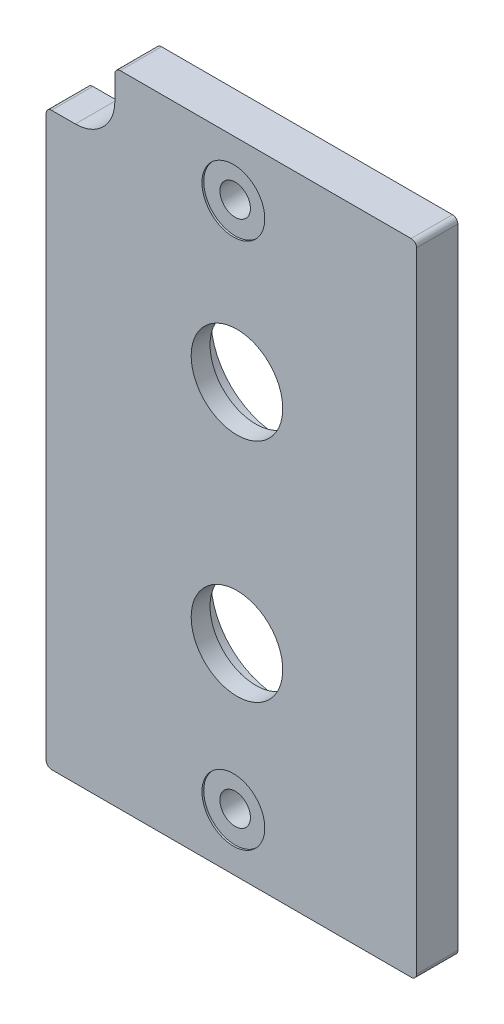
ISO-10303-21;
HEADER;
FILE_DESCRIPTION(('STEP AP214'),'2;1');
FILE_NAME('part.step','',(''),(''),'','','');
FILE_SCHEMA(('AUTOMOTIVE_DESIGN { 1 0 10303 214 1 1 1 1 }'));
ENDSEC;
DATA;
#1=APPLICATION_CONTEXT('core data for automotive mechanical design processes');
#2=APPLICATION_PROTOCOL_DEFINITION('international standard','automotive_design',2000,#1);
#3=PRODUCT_CONTEXT('',#1,'mechanical');
#4=PRODUCT('Part','Part','',(#3));
#5=PRODUCT_RELATED_PRODUCT_CATEGORY('part','',(#4));
#6=PRODUCT_DEFINITION_FORMATION('','',#4);
#7=PRODUCT_DEFINITION_CONTEXT('part definition',#1,'design');
#8=PRODUCT_DEFINITION('design','',#6,#7);
#9=PRODUCT_DEFINITION_SHAPE('','',#8);
#10=(LENGTH_UNIT() NAMED_UNIT(*) SI_UNIT(.MILLI.,.METRE.));
#11=(NAMED_UNIT(*) PLANE_ANGLE_UNIT() SI_UNIT($,.RADIAN.));
#12=(NAMED_UNIT(*) SI_UNIT($,.STERADIAN.) SOLID_ANGLE_UNIT());
#13=UNCERTAINTY_MEASURE_WITH_UNIT(LENGTH_MEASURE(1.E-05),#10,'distance_accuracy_value','');
#14=(GEOMETRIC_REPRESENTATION_CONTEXT(3) GLOBAL_UNCERTAINTY_ASSIGNED_CONTEXT((#13)) GLOBAL_UNIT_ASSIGNED_CONTEXT((#10,
#11,#12)) REPRESENTATION_CONTEXT('',''));
#15=CARTESIAN_POINT('',(0.,0.,0.));
#16=DIRECTION('',(0.,0.,1.));
#17=DIRECTION('',(1.,0.,0.));
#18=AXIS2_PLACEMENT_3D('',#15,#16,#17);
#19=CARTESIAN_POINT('',(-28.448,126.365,7.1755));
#20=DIRECTION('',(0.,0.,-1.));
#21=DIRECTION('',(-1.,0.,0.));
#22=AXIS2_PLACEMENT_3D('',#19,#20,#21);
#23=CYLINDRICAL_SURFACE('',#22,2.15900000000002);
#24=CARTESIAN_POINT('',(-28.448,126.365,1.5875));
#25=DIRECTION('',(0.,0.,-1.));
#26=DIRECTION('',(-1.,0.,0.));
#27=AXIS2_PLACEMENT_3D('',#24,#25,#26);
#28=CIRCLE('',#27,2.15900000000002);
#29=CARTESIAN_POINT('',(-30.607,126.365,1.5875));
#30=VERTEX_POINT('',#29);
#31=EDGE_CURVE('E216',#30,#30,#28,.F.);
#32=ORIENTED_EDGE('',*,*,#31,.F.);
#33=EDGE_LOOP('',(#32));
#34=FACE_BOUND('',#33,.T.);
#35=CARTESIAN_POINT('',(-28.448,126.365,7.1755));
#36=DIRECTION('',(0.,0.,-1.));
#37=DIRECTION('',(-1.,0.,0.));
#38=AXIS2_PLACEMENT_3D('',#35,#36,#37);
#39=CIRCLE('',#38,2.15900000000002);
#40=CARTESIAN_POINT('',(-30.607,126.365,7.1755));
#41=VERTEX_POINT('',#40);
#42=EDGE_CURVE('E238',#41,#41,#39,.T.);
#43=ORIENTED_EDGE('',*,*,#42,.F.);
#44=EDGE_LOOP('',(#43));
#45=FACE_BOUND('',#44,.T.);
#46=ADVANCED_FACE('F16',(#34,#45),#23,.F.);
#47=CARTESIAN_POINT('',(-27.94,72.39,1.5875));
#48=DIRECTION('',(0.,0.,1.));
#49=DIRECTION('',(1.,0.,0.));
#50=AXIS2_PLACEMENT_3D('',#47,#48,#49);
#51=CYLINDRICAL_SURFACE('',#50,9.525);
#52=CARTESIAN_POINT('',(-27.94,72.39,4.7625));
#53=DIRECTION('',(0.,0.,1.));
#54=DIRECTION('',(1.,0.,0.));
#55=AXIS2_PLACEMENT_3D('',#52,#53,#54);
#56=CIRCLE('',#55,9.525);
#57=CARTESIAN_POINT('',(-18.415,72.39,4.7625));
#58=VERTEX_POINT('',#57);
#59=EDGE_CURVE('E232',#58,#58,#56,.F.);
#60=ORIENTED_EDGE('',*,*,#59,.F.);
#61=EDGE_LOOP('',(#60));
#62=FACE_BOUND('',#61,.T.);
#63=CARTESIAN_POINT('',(-27.94,72.39,1.5875));
#64=DIRECTION('',(0.,0.,1.));
#65=DIRECTION('',(1.,0.,0.));
#66=AXIS2_PLACEMENT_3D('',#63,#64,#65);
#67=CIRCLE('',#66,9.525);
#68=CARTESIAN_POINT('',(-18.415,72.39,1.5875));
#69=VERTEX_POINT('',#68);
#70=EDGE_CURVE('E213',#69,#69,#67,.T.);
#71=ORIENTED_EDGE('',*,*,#70,.F.);
#72=EDGE_LOOP('',(#71));
#73=FACE_BOUND('',#72,.T.);
#74=ADVANCED_FACE('F504',(#62,#73),#51,.F.);
#75=CARTESIAN_POINT('',(-27.94,104.394,1.5875));
#76=DIRECTION('',(0.,0.,1.));
#77=DIRECTION('',(1.,0.,0.));
#78=AXIS2_PLACEMENT_3D('',#75,#76,#77);
#79=CYLINDRICAL_SURFACE('',#78,9.52499999999999);
#80=CARTESIAN_POINT('',(-27.94,104.394,4.7625));
#81=DIRECTION('',(0.,0.,1.));
#82=DIRECTION('',(1.,0.,0.));
#83=AXIS2_PLACEMENT_3D('',#80,#81,#82);
#84=CIRCLE('',#83,9.52499999999999);
#85=CARTESIAN_POINT('',(-18.415,104.394,4.7625));
#86=VERTEX_POINT('',#85);
#87=EDGE_CURVE('E235',#86,#86,#84,.F.);
#88=ORIENTED_EDGE('',*,*,#87,.F.);
#89=EDGE_LOOP('',(#88));
#90=FACE_BOUND('',#89,.T.);
#91=CARTESIAN_POINT('',(-27.94,104.394,1.5875));
#92=DIRECTION('',(0.,0.,1.));
#93=DIRECTION('',(1.,0.,0.));
#94=AXIS2_PLACEMENT_3D('',#91,#92,#93);
#95=CIRCLE('',#94,9.52499999999999);
#96=CARTESIAN_POINT('',(-18.415,104.394,1.5875));
#97=VERTEX_POINT('',#96);
#98=EDGE_CURVE('E171',#97,#97,#95,.T.);
#99=ORIENTED_EDGE('',*,*,#98,.F.);
#100=EDGE_LOOP('',(#99));
#101=FACE_BOUND('',#100,.T.);
#102=ADVANCED_FACE('F496',(#90,#101),#79,.F.);
#103=CARTESIAN_POINT('',(-54.1654999999997,44.577,7.4295));
#104=DIRECTION('',(0.,0.,-1.));
#105=DIRECTION('',(-1.,0.,0.));
#106=AXIS2_PLACEMENT_3D('',#103,#104,#105);
#107=CYLINDRICAL_SURFACE('',#106,0.762000000000004);
#108=CARTESIAN_POINT('',(-54.1654999999997,44.577,1.5875));
#109=DIRECTION('',(0.,0.,-1.));
#110=DIRECTION('',(-1.,0.,0.));
#111=AXIS2_PLACEMENT_3D('',#108,#109,#110);
#112=CIRCLE('',#111,0.762000000000004);
#113=CARTESIAN_POINT('',(-54.1654999999997,43.815,1.5875));
#114=VERTEX_POINT('',#113);
#115=CARTESIAN_POINT('',(-54.9274999999997,44.577,1.5875));
#116=VERTEX_POINT('',#115);
#117=EDGE_CURVE('E219',#114,#116,#112,.T.);
#118=ORIENTED_EDGE('',*,*,#117,.F.);
#119=DIRECTION('',(0.,0.,-1.));
#120=VECTOR('',#119,1.);
#121=CARTESIAN_POINT('',(-54.1654999999997,43.815,4.50850000000001));
#122=LINE('',#121,#120);
#123=CARTESIAN_POINT('',(-54.1654999999997,43.815,7.4295));
#124=VERTEX_POINT('',#123);
#125=EDGE_CURVE('E112',#124,#114,#122,.T.);
#126=ORIENTED_EDGE('',*,*,#125,.F.);
#127=CARTESIAN_POINT('',(-54.1654999999997,44.577,7.4295));
#128=DIRECTION('',(0.,0.,-1.));
#129=DIRECTION('',(-1.,0.,0.));
#130=AXIS2_PLACEMENT_3D('',#127,#128,#129);
#131=CIRCLE('',#130,0.762000000000004);
#132=CARTESIAN_POINT('',(-54.9274999999999,44.577,7.4295));
#133=VERTEX_POINT('',#132);
#134=EDGE_CURVE('E20',#124,#133,#131,.T.);
#135=ORIENTED_EDGE('',*,*,#134,.T.);
#136=DIRECTION('',(0.,0.,1.));
#137=VECTOR('',#136,1.);
#138=CARTESIAN_POINT('',(-54.9274999999997,44.577,4.50850000000001));
#139=LINE('',#138,#137);
#140=EDGE_CURVE('E109',#116,#133,#139,.T.);
#141=ORIENTED_EDGE('',*,*,#140,.F.);
#142=EDGE_LOOP('',(#118,#126,#135,#141));
#143=FACE_BOUND('',#142,.T.);
#144=ADVANCED_FACE('F108',(#143),#107,.T.);
#145=CARTESIAN_POINT('',(-3.302,44.577,7.4295));
#146=DIRECTION('',(0.,0.,-1.));
#147=DIRECTION('',(-1.,0.,0.));
#148=AXIS2_PLACEMENT_3D('',#145,#146,#147);
#149=CYLINDRICAL_SURFACE('',#148,0.761999999999999);
#150=CARTESIAN_POINT('',(-3.302,44.577,1.5875));
#151=DIRECTION('',(0.,0.,-1.));
#152=DIRECTION('',(-1.,0.,0.));
#153=AXIS2_PLACEMENT_3D('',#150,#151,#152);
#154=CIRCLE('',#153,0.761999999999999);
#155=CARTESIAN_POINT('',(-2.54,44.577,1.5875));
#156=VERTEX_POINT('',#155);
#157=CARTESIAN_POINT('',(-3.302,43.815,1.5875));
#158=VERTEX_POINT('',#157);
#159=EDGE_CURVE('E221',#156,#158,#154,.T.);
#160=ORIENTED_EDGE('',*,*,#159,.F.);
#161=DIRECTION('',(0.,0.,-1.));
#162=VECTOR('',#161,1.);
#163=CARTESIAN_POINT('',(-2.54,44.577,4.50850000000001));
#164=LINE('',#163,#162);
#165=CARTESIAN_POINT('',(-2.54,44.577,7.4295));
#166=VERTEX_POINT('',#165);
#167=EDGE_CURVE('E159',#166,#156,#164,.T.);
#168=ORIENTED_EDGE('',*,*,#167,.F.);
#169=CARTESIAN_POINT('',(-3.302,44.577,7.4295));
#170=DIRECTION('',(0.,0.,-1.));
#171=DIRECTION('',(-1.,0.,0.));
#172=AXIS2_PLACEMENT_3D('',#169,#170,#171);
#173=CIRCLE('',#172,0.761999999999999);
#174=CARTESIAN_POINT('',(-3.302,43.815,7.4295));
#175=VERTEX_POINT('',#174);
#176=EDGE_CURVE('E114',#166,#175,#173,.T.);
#177=ORIENTED_EDGE('',*,*,#176,.T.);
#178=DIRECTION('',(0.,0.,1.));
#179=VECTOR('',#178,1.);
#180=CARTESIAN_POINT('',(-3.302,43.815,4.50850000000001));
#181=LINE('',#180,#179);
#182=EDGE_CURVE('E165',#158,#175,#181,.T.);
#183=ORIENTED_EDGE('',*,*,#182,.F.);
#184=EDGE_LOOP('',(#160,#168,#177,#183));
#185=FACE_BOUND('',#184,.T.);
#186=ADVANCED_FACE('F248',(#185),#149,.T.);
#187=CARTESIAN_POINT('',(-3.302,133.5405,7.4295));
#188=DIRECTION('',(0.,0.,-1.));
#189=DIRECTION('',(-1.,0.,0.));
#190=AXIS2_PLACEMENT_3D('',#187,#188,#189);
#191=CYLINDRICAL_SURFACE('',#190,0.761999999999991);
#192=CARTESIAN_POINT('',(-3.302,133.5405,1.5875));
#193=DIRECTION('',(0.,0.,-1.));
#194=DIRECTION('',(-1.,0.,0.));
#195=AXIS2_PLACEMENT_3D('',#192,#193,#194);
#196=CIRCLE('',#195,0.761999999999991);
#197=CARTESIAN_POINT('',(-3.302,134.3025,1.5875));
#198=VERTEX_POINT('',#197);
#199=CARTESIAN_POINT('',(-2.54,133.5405,1.5875));
#200=VERTEX_POINT('',#199);
#201=EDGE_CURVE('E223',#198,#200,#196,.T.);
#202=ORIENTED_EDGE('',*,*,#201,.F.);
#203=DIRECTION('',(0.,0.,-1.));
#204=VECTOR('',#203,1.);
#205=CARTESIAN_POINT('',(-3.302,134.3025,4.50850000000001));
#206=LINE('',#205,#204);
#207=CARTESIAN_POINT('',(-3.302,134.3025,7.4295));
#208=VERTEX_POINT('',#207);
#209=EDGE_CURVE('E152',#208,#198,#206,.T.);
#210=ORIENTED_EDGE('',*,*,#209,.F.);
#211=CARTESIAN_POINT('',(-3.302,133.5405,7.4295));
#212=DIRECTION('',(0.,0.,-1.));
#213=DIRECTION('',(-1.,0.,0.));
#214=AXIS2_PLACEMENT_3D('',#211,#212,#213);
#215=CIRCLE('',#214,0.761999999999991);
#216=CARTESIAN_POINT('',(-2.54,133.5405,7.4295));
#217=VERTEX_POINT('',#216);
#218=EDGE_CURVE('E244',#208,#217,#215,.T.);
#219=ORIENTED_EDGE('',*,*,#218,.T.);
#220=DIRECTION('',(0.,0.,1.));
#221=VECTOR('',#220,1.);
#222=CARTESIAN_POINT('',(-2.54,133.5405,4.50850000000001));
#223=LINE('',#222,#221);
#224=EDGE_CURVE('E162',#200,#217,#223,.T.);
#225=ORIENTED_EDGE('',*,*,#224,.F.);
#226=EDGE_LOOP('',(#202,#210,#219,#225));
#227=FACE_BOUND('',#226,.T.);
#228=ADVANCED_FACE('F284',(#227),#191,.T.);
#229=CARTESIAN_POINT('',(-44.45,133.5405,7.4295));
#230=DIRECTION('',(0.,0.,-1.));
#231=DIRECTION('',(-1.,0.,0.));
#232=AXIS2_PLACEMENT_3D('',#229,#230,#231);
#233=CYLINDRICAL_SURFACE('',#232,0.761999999999992);
#234=CARTESIAN_POINT('',(-44.45,133.5405,1.5875));
#235=DIRECTION('',(0.,0.,-1.));
#236=DIRECTION('',(-1.,0.,0.));
#237=AXIS2_PLACEMENT_3D('',#234,#235,#236);
#238=CIRCLE('',#237,0.761999999999992);
#239=CARTESIAN_POINT('',(-45.212,133.5405,1.5875));
#240=VERTEX_POINT('',#239);
#241=CARTESIAN_POINT('',(-44.45,134.3025,1.5875));
#242=VERTEX_POINT('',#241);
#243=EDGE_CURVE('E226',#240,#242,#238,.T.);
#244=ORIENTED_EDGE('',*,*,#243,.F.);
#245=DIRECTION('',(0.,0.,-1.));
#246=VECTOR('',#245,1.);
#247=CARTESIAN_POINT('',(-45.212,133.5405,4.50850000000001));
#248=LINE('',#247,#246);
#249=CARTESIAN_POINT('',(-45.212,133.5405,7.4295));
#250=VERTEX_POINT('',#249);
#251=EDGE_CURVE('E147',#250,#240,#248,.T.);
#252=ORIENTED_EDGE('',*,*,#251,.F.);
#253=CARTESIAN_POINT('',(-44.45,133.5405,7.4295));
#254=DIRECTION('',(0.,0.,-1.));
#255=DIRECTION('',(-1.,0.,0.));
#256=AXIS2_PLACEMENT_3D('',#253,#254,#255);
#257=CIRCLE('',#256,0.761999999999992);
#258=CARTESIAN_POINT('',(-44.45,134.3025,7.4295));
#259=VERTEX_POINT('',#258);
#260=EDGE_CURVE('E242',#250,#259,#257,.T.);
#261=ORIENTED_EDGE('',*,*,#260,.T.);
#262=DIRECTION('',(0.,0.,1.));
#263=VECTOR('',#262,1.);
#264=CARTESIAN_POINT('',(-44.45,134.3025,4.50850000000001));
#265=LINE('',#264,#263);
#266=EDGE_CURVE('E155',#242,#259,#265,.T.);
#267=ORIENTED_EDGE('',*,*,#266,.F.);
#268=EDGE_LOOP('',(#244,#252,#261,#267));
#269=FACE_BOUND('',#268,.T.);
#270=ADVANCED_FACE('F279',(#269),#233,.T.);
#271=CARTESIAN_POINT('',(-54.1655,123.825,7.4295));
#272=DIRECTION('',(0.,0.,-1.));
#273=DIRECTION('',(-1.,0.,0.));
#274=AXIS2_PLACEMENT_3D('',#271,#272,#273);
#275=CYLINDRICAL_SURFACE('',#274,0.762000000000001);
#276=CARTESIAN_POINT('',(-54.1655,123.825,1.5875));
#277=DIRECTION('',(0.,0.,-1.));
#278=DIRECTION('',(-1.,0.,0.));
#279=AXIS2_PLACEMENT_3D('',#276,#277,#278);
#280=CIRCLE('',#279,0.762000000000001);
#281=CARTESIAN_POINT('',(-54.9275,123.825,1.5875));
#282=VERTEX_POINT('',#281);
#283=CARTESIAN_POINT('',(-54.1655,124.587,1.5875));
#284=VERTEX_POINT('',#283);
#285=EDGE_CURVE('E229',#282,#284,#280,.T.);
#286=ORIENTED_EDGE('',*,*,#285,.F.);
#287=DIRECTION('',(0.,0.,-1.));
#288=VECTOR('',#287,1.);
#289=CARTESIAN_POINT('',(-54.9275,123.825,4.50850000000001));
#290=LINE('',#289,#288);
#291=CARTESIAN_POINT('',(-54.9275,123.825,7.4295));
#292=VERTEX_POINT('',#291);
#293=EDGE_CURVE('E170',#292,#282,#290,.T.);
#294=ORIENTED_EDGE('',*,*,#293,.F.);
#295=CARTESIAN_POINT('',(-54.1655,123.825,7.4295));
#296=DIRECTION('',(0.,0.,-1.));
#297=DIRECTION('',(-1.,0.,0.));
#298=AXIS2_PLACEMENT_3D('',#295,#296,#297);
#299=CIRCLE('',#298,0.762000000000001);
#300=CARTESIAN_POINT('',(-54.1655,124.587,7.4295));
#301=VERTEX_POINT('',#300);
#302=EDGE_CURVE('E126',#292,#301,#299,.T.);
#303=ORIENTED_EDGE('',*,*,#302,.T.);
#304=DIRECTION('',(0.,0.,1.));
#305=VECTOR('',#304,1.);
#306=CARTESIAN_POINT('',(-54.1655,124.587,4.50850000000001));
#307=LINE('',#306,#305);
#308=EDGE_CURVE('E140',#284,#301,#307,.T.);
#309=ORIENTED_EDGE('',*,*,#308,.F.);
#310=EDGE_LOOP('',(#286,#294,#303,#309));
#311=FACE_BOUND('',#310,.T.);
#312=ADVANCED_FACE('F270',(#311),#275,.T.);
#313=CARTESIAN_POINT('',(-23.993,130.82,7.1755));
#314=DIRECTION('',(0.,0.,1.));
#315=DIRECTION('',(-1.,0.,0.));
#316=AXIS2_PLACEMENT_3D('',#313,#314,#315);
#317=PLANE('',#316);
#318=ORIENTED_EDGE('',*,*,#42,.T.);
#319=EDGE_LOOP('',(#318));
#320=FACE_BOUND('',#319,.T.);
#321=CARTESIAN_POINT('',(-28.448,126.365,7.1755));
#322=DIRECTION('',(0.,0.,-1.));
#323=DIRECTION('',(-1.,0.,0.));
#324=AXIS2_PLACEMENT_3D('',#321,#322,#323);
#325=CIRCLE('',#324,4.44500000000001);
#326=CARTESIAN_POINT('',(-32.893,126.365,7.1755));
#327=VERTEX_POINT('',#326);
#328=EDGE_CURVE('E175',#327,#327,#325,.T.);
#329=ORIENTED_EDGE('',*,*,#328,.F.);
#330=EDGE_LOOP('',(#329));
#331=FACE_BOUND('',#330,.T.);
#332=ADVANCED_FACE('F352',(#320,#331),#317,.T.);
#333=CARTESIAN_POINT('',(-37.475,113.929,4.7625));
#334=DIRECTION('',(0.,0.,-1.));
#335=DIRECTION('',(1.,0.,0.));
#336=AXIS2_PLACEMENT_3D('',#333,#334,#335);
#337=PLANE('',#336);
#338=CARTESIAN_POINT('',(-27.94,104.394,4.7625));
#339=DIRECTION('',(0.,0.,-1.));
#340=DIRECTION('',(-1.,0.,0.));
#341=AXIS2_PLACEMENT_3D('',#338,#339,#340);
#342=CIRCLE('',#341,6.47699999999999);
#343=CARTESIAN_POINT('',(-34.417,104.394,4.7625));
#344=VERTEX_POINT('',#343);
#345=EDGE_CURVE('E205',#344,#344,#342,.T.);
#346=ORIENTED_EDGE('',*,*,#345,.F.);
#347=EDGE_LOOP('',(#346));
#348=FACE_BOUND('',#347,.T.);
#349=ORIENTED_EDGE('',*,*,#87,.T.);
#350=EDGE_LOOP('',(#349));
#351=FACE_BOUND('',#350,.T.);
#352=ADVANCED_FACE('F348',(#348,#351),#337,.T.);
#353=CARTESIAN_POINT('',(-37.475,81.925,4.7625));
#354=DIRECTION('',(0.,0.,-1.));
#355=DIRECTION('',(1.,0.,0.));
#356=AXIS2_PLACEMENT_3D('',#353,#354,#355);
#357=PLANE('',#356);
#358=CARTESIAN_POINT('',(-27.94,72.39,4.7625));
#359=DIRECTION('',(0.,0.,-1.));
#360=DIRECTION('',(-1.,0.,0.));
#361=AXIS2_PLACEMENT_3D('',#358,#359,#360);
#362=CIRCLE('',#361,6.477);
#363=CARTESIAN_POINT('',(-34.417,72.39,4.7625));
#364=VERTEX_POINT('',#363);
#365=EDGE_CURVE('E134',#364,#364,#362,.T.);
#366=ORIENTED_EDGE('',*,*,#365,.F.);
#367=EDGE_LOOP('',(#366));
#368=FACE_BOUND('',#367,.T.);
#369=ORIENTED_EDGE('',*,*,#59,.T.);
#370=EDGE_LOOP('',(#369));
#371=FACE_BOUND('',#370,.T.);
#372=ADVANCED_FACE('F344',(#368,#371),#357,.T.);
#373=CARTESIAN_POINT('',(-54.9375,134.3125,1.5875));
#374=DIRECTION('',(0.,0.,-1.));
#375=DIRECTION('',(1.,0.,0.));
#376=AXIS2_PLACEMENT_3D('',#373,#374,#375);
#377=PLANE('',#376);
#378=ORIENTED_EDGE('',*,*,#98,.T.);
#379=EDGE_LOOP('',(#378));
#380=FACE_BOUND('',#379,.T.);
#381=ORIENTED_EDGE('',*,*,#70,.T.);
#382=EDGE_LOOP('',(#381));
#383=FACE_BOUND('',#382,.T.);
#384=ORIENTED_EDGE('',*,*,#31,.T.);
#385=EDGE_LOOP('',(#384));
#386=FACE_BOUND('',#385,.T.);
#387=CARTESIAN_POINT('',(-28.448,51.7525,1.5875));
#388=DIRECTION('',(0.,0.,-1.));
#389=DIRECTION('',(0.,1.,0.));
#390=AXIS2_PLACEMENT_3D('',#387,#388,#389);
#391=CIRCLE('',#390,2.159);
#392=CARTESIAN_POINT('',(-28.448,53.9115,1.5875));
#393=VERTEX_POINT('',#392);
#394=EDGE_CURVE('E129',#393,#393,#391,.T.);
#395=ORIENTED_EDGE('',*,*,#394,.F.);
#396=EDGE_LOOP('',(#395));
#397=FACE_BOUND('',#396,.T.);
#398=ORIENTED_EDGE('',*,*,#117,.T.);
#399=DIRECTION('',(0.,-1.,0.));
#400=VECTOR('',#399,1.);
#401=CARTESIAN_POINT('',(-54.9274999999999,84.201,1.5875));
#402=LINE('',#401,#400);
#403=EDGE_CURVE('E121',#282,#116,#402,.T.);
#404=ORIENTED_EDGE('',*,*,#403,.F.);
#405=ORIENTED_EDGE('',*,*,#285,.T.);
#406=DIRECTION('',(-1.,0.,0.));
#407=VECTOR('',#406,1.);
#408=CARTESIAN_POINT('',(-52.48275,124.587,1.5875));
#409=LINE('',#408,#407);
#410=CARTESIAN_POINT('',(-50.8,124.587,1.5875));
#411=VERTEX_POINT('',#410);
#412=EDGE_CURVE('E139',#411,#284,#409,.T.);
#413=ORIENTED_EDGE('',*,*,#412,.F.);
#414=CARTESIAN_POINT('',(-50.8,130.175,1.5875));
#415=DIRECTION('',(0.,0.,1.));
#416=DIRECTION('',(1.,0.,0.));
#417=AXIS2_PLACEMENT_3D('',#414,#415,#416);
#418=CIRCLE('',#417,5.58799999999998);
#419=CARTESIAN_POINT('',(-45.212,130.175,1.5875));
#420=VERTEX_POINT('',#419);
#421=EDGE_CURVE('E146',#420,#411,#418,.F.);
#422=ORIENTED_EDGE('',*,*,#421,.F.);
#423=DIRECTION('',(0.,-1.,0.));
#424=VECTOR('',#423,1.);
#425=CARTESIAN_POINT('',(-45.212,131.85775,1.5875));
#426=LINE('',#425,#424);
#427=EDGE_CURVE('E150',#240,#420,#426,.T.);
#428=ORIENTED_EDGE('',*,*,#427,.F.);
#429=ORIENTED_EDGE('',*,*,#243,.T.);
#430=DIRECTION('',(-1.,0.,0.));
#431=VECTOR('',#430,1.);
#432=CARTESIAN_POINT('',(-23.876,134.3025,1.5875));
#433=LINE('',#432,#431);
#434=EDGE_CURVE('E151',#198,#242,#433,.T.);
#435=ORIENTED_EDGE('',*,*,#434,.F.);
#436=ORIENTED_EDGE('',*,*,#201,.T.);
#437=DIRECTION('',(0.,1.,0.));
#438=VECTOR('',#437,1.);
#439=CARTESIAN_POINT('',(-2.54,89.05875,1.5875));
#440=LINE('',#439,#438);
#441=EDGE_CURVE('E158',#156,#200,#440,.T.);
#442=ORIENTED_EDGE('',*,*,#441,.F.);
#443=ORIENTED_EDGE('',*,*,#159,.T.);
#444=DIRECTION('',(1.,0.,0.));
#445=VECTOR('',#444,1.);
#446=CARTESIAN_POINT('',(-28.73375,43.815,1.5875));
#447=LINE('',#446,#445);
#448=EDGE_CURVE('E167',#114,#158,#447,.T.);
#449=ORIENTED_EDGE('',*,*,#448,.F.);
#450=EDGE_LOOP('',(#398,#404,#405,#413,#422,#428,#429,#435,#436,#442,#443,#449));
#451=FACE_BOUND('',#450,.T.);
#452=ADVANCED_FACE('F255',(#380,#383,#386,#397,#451),#377,.T.);
#453=CARTESIAN_POINT('',(-54.9275,123.835,1.5775));
#454=DIRECTION('',(-1.,0.,0.));
#455=DIRECTION('',(0.,-1.,0.));
#456=AXIS2_PLACEMENT_3D('',#453,#454,#455);
#457=PLANE('',#456);
#458=ORIENTED_EDGE('',*,*,#140,.T.);
#459=DIRECTION('',(0.,-1.,0.));
#460=VECTOR('',#459,1.);
#461=CARTESIAN_POINT('',(-54.9275,89.05875,7.4295));
#462=LINE('',#461,#460);
#463=EDGE_CURVE('E119',#292,#133,#462,.T.);
#464=ORIENTED_EDGE('',*,*,#463,.F.);
#465=ORIENTED_EDGE('',*,*,#293,.T.);
#466=ORIENTED_EDGE('',*,*,#403,.T.);
#467=EDGE_LOOP('',(#458,#464,#465,#466));
#468=FACE_BOUND('',#467,.T.);
#469=ADVANCED_FACE('F117',(#468),#457,.T.);
#470=CARTESIAN_POINT('',(-54.1755,43.815,1.5775));
#471=DIRECTION('',(0.,-1.,0.));
#472=DIRECTION('',(1.,0.,0.));
#473=AXIS2_PLACEMENT_3D('',#470,#471,#472);
#474=PLANE('',#473);
#475=ORIENTED_EDGE('',*,*,#182,.T.);
#476=DIRECTION('',(1.,0.,0.));
#477=VECTOR('',#476,1.);
#478=CARTESIAN_POINT('',(-28.73375,43.815,7.4295));
#479=LINE('',#478,#477);
#480=EDGE_CURVE('E128',#124,#175,#479,.T.);
#481=ORIENTED_EDGE('',*,*,#480,.F.);
#482=ORIENTED_EDGE('',*,*,#125,.T.);
#483=ORIENTED_EDGE('',*,*,#448,.T.);
#484=EDGE_LOOP('',(#475,#481,#482,#483));
#485=FACE_BOUND('',#484,.T.);
#486=ADVANCED_FACE('F252',(#485),#474,.T.);
#487=CARTESIAN_POINT('',(-2.54,44.567,1.5775));
#488=DIRECTION('',(1.,0.,0.));
#489=DIRECTION('',(0.,1.,0.));
#490=AXIS2_PLACEMENT_3D('',#487,#488,#489);
#491=PLANE('',#490);
#492=ORIENTED_EDGE('',*,*,#167,.T.);
#493=ORIENTED_EDGE('',*,*,#441,.T.);
#494=ORIENTED_EDGE('',*,*,#224,.T.);
#495=DIRECTION('',(0.,1.,0.));
#496=VECTOR('',#495,1.);
#497=CARTESIAN_POINT('',(-2.54,89.05875,7.4295));
#498=LINE('',#497,#496);
#499=EDGE_CURVE('E131',#166,#217,#498,.T.);
#500=ORIENTED_EDGE('',*,*,#499,.F.);
#501=EDGE_LOOP('',(#492,#493,#494,#500));
#502=FACE_BOUND('',#501,.T.);
#503=ADVANCED_FACE('F259',(#502),#491,.T.);
#504=CARTESIAN_POINT('',(-3.29199999999999,134.3025,1.5775));
#505=DIRECTION('',(0.,1.,0.));
#506=DIRECTION('',(-1.,0.,0.));
#507=AXIS2_PLACEMENT_3D('',#504,#505,#506);
#508=PLANE('',#507);
#509=ORIENTED_EDGE('',*,*,#209,.T.);
#510=ORIENTED_EDGE('',*,*,#434,.T.);
#511=ORIENTED_EDGE('',*,*,#266,.T.);
#512=DIRECTION('',(-1.,0.,0.));
#513=VECTOR('',#512,1.);
#514=CARTESIAN_POINT('',(-28.73375,134.3025,7.4295));
#515=LINE('',#514,#513);
#516=EDGE_CURVE('E260',#208,#259,#515,.T.);
#517=ORIENTED_EDGE('',*,*,#516,.F.);
#518=EDGE_LOOP('',(#509,#510,#511,#517));
#519=FACE_BOUND('',#518,.T.);
#520=ADVANCED_FACE('F281',(#519),#508,.T.);
#521=CARTESIAN_POINT('',(-45.212,133.5505,1.5775));
#522=DIRECTION('',(-1.,0.,0.));
#523=DIRECTION('',(0.,-1.,0.));
#524=AXIS2_PLACEMENT_3D('',#521,#522,#523);
#525=PLANE('',#524);
#526=DIRECTION('',(0.,0.,-1.));
#527=VECTOR('',#526,1.);
#528=CARTESIAN_POINT('',(-45.212,130.175,4.5085));
#529=LINE('',#528,#527);
#530=CARTESIAN_POINT('',(-45.212,130.175,7.4295));
#531=VERTEX_POINT('',#530);
#532=EDGE_CURVE('E143',#531,#420,#529,.T.);
#533=ORIENTED_EDGE('',*,*,#532,.F.);
#534=DIRECTION('',(0.,-1.,0.));
#535=VECTOR('',#534,1.);
#536=CARTESIAN_POINT('',(-45.212,89.05875,7.4295));
#537=LINE('',#536,#535);
#538=EDGE_CURVE('E201',#250,#531,#537,.T.);
#539=ORIENTED_EDGE('',*,*,#538,.F.);
#540=ORIENTED_EDGE('',*,*,#251,.T.);
#541=ORIENTED_EDGE('',*,*,#427,.T.);
#542=EDGE_LOOP('',(#533,#539,#540,#541));
#543=FACE_BOUND('',#542,.T.);
#544=ADVANCED_FACE('F273',(#543),#525,.T.);
#545=CARTESIAN_POINT('',(-50.8,130.175,1.5875));
#546=DIRECTION('',(0.,0.,1.));
#547=DIRECTION('',(1.,0.,0.));
#548=AXIS2_PLACEMENT_3D('',#545,#546,#547);
#549=CYLINDRICAL_SURFACE('',#548,5.58799999999998);
#550=CARTESIAN_POINT('',(-50.8,130.175,7.4295));
#551=DIRECTION('',(0.,0.,1.));
#552=DIRECTION('',(1.,0.,0.));
#553=AXIS2_PLACEMENT_3D('',#550,#551,#552);
#554=CIRCLE('',#553,5.58799999999998);
#555=CARTESIAN_POINT('',(-50.8,124.587,7.4295));
#556=VERTEX_POINT('',#555);
#557=EDGE_CURVE('E200',#531,#556,#554,.F.);
#558=ORIENTED_EDGE('',*,*,#557,.F.);
#559=ORIENTED_EDGE('',*,*,#532,.T.);
#560=ORIENTED_EDGE('',*,*,#421,.T.);
#561=DIRECTION('',(0.,0.,-1.));
#562=VECTOR('',#561,1.);
#563=CARTESIAN_POINT('',(-50.8,124.587,4.50850000000001));
#564=LINE('',#563,#562);
#565=EDGE_CURVE('E35',#556,#411,#564,.T.);
#566=ORIENTED_EDGE('',*,*,#565,.F.);
#567=EDGE_LOOP('',(#558,#559,#560,#566));
#568=FACE_BOUND('',#567,.T.);
#569=ADVANCED_FACE('F276',(#568),#549,.F.);
#570=CARTESIAN_POINT('',(-50.79,124.587,1.5775));
#571=DIRECTION('',(0.,1.,0.));
#572=DIRECTION('',(-1.,0.,0.));
#573=AXIS2_PLACEMENT_3D('',#570,#571,#572);
#574=PLANE('',#573);
#575=ORIENTED_EDGE('',*,*,#565,.T.);
#576=ORIENTED_EDGE('',*,*,#412,.T.);
#577=ORIENTED_EDGE('',*,*,#308,.T.);
#578=DIRECTION('',(-1.,0.,0.));
#579=VECTOR('',#578,1.);
#580=CARTESIAN_POINT('',(-28.73375,124.587,7.4295));
#581=LINE('',#580,#579);
#582=EDGE_CURVE('E199',#556,#301,#581,.T.);
#583=ORIENTED_EDGE('',*,*,#582,.F.);
#584=EDGE_LOOP('',(#575,#576,#577,#583));
#585=FACE_BOUND('',#584,.T.);
#586=ADVANCED_FACE('F267',(#585),#574,.T.);
#587=CARTESIAN_POINT('',(-28.448,126.365,7.4295));
#588=DIRECTION('',(0.,0.,-1.));
#589=DIRECTION('',(-1.,0.,0.));
#590=AXIS2_PLACEMENT_3D('',#587,#588,#589);
#591=CYLINDRICAL_SURFACE('',#590,4.44500000000001);
#592=ORIENTED_EDGE('',*,*,#328,.T.);
#593=EDGE_LOOP('',(#592));
#594=FACE_BOUND('',#593,.T.);
#595=CARTESIAN_POINT('',(-28.448,126.365,7.4295));
#596=DIRECTION('',(0.,0.,-1.));
#597=DIRECTION('',(-1.,0.,0.));
#598=AXIS2_PLACEMENT_3D('',#595,#596,#597);
#599=CIRCLE('',#598,4.44500000000001);
#600=CARTESIAN_POINT('',(-32.893,126.365,7.4295));
#601=VERTEX_POINT('',#600);
#602=EDGE_CURVE('E196',#601,#601,#599,.T.);
#603=ORIENTED_EDGE('',*,*,#602,.F.);
#604=EDGE_LOOP('',(#603));
#605=FACE_BOUND('',#604,.T.);
#606=ADVANCED_FACE('F323',(#594,#605),#591,.F.);
#607=CARTESIAN_POINT('',(-27.94,104.394,7.4295));
#608=DIRECTION('',(0.,0.,-1.));
#609=DIRECTION('',(-1.,0.,0.));
#610=AXIS2_PLACEMENT_3D('',#607,#608,#609);
#611=CYLINDRICAL_SURFACE('',#610,6.47699999999999);
#612=ORIENTED_EDGE('',*,*,#345,.T.);
#613=EDGE_LOOP('',(#612));
#614=FACE_BOUND('',#613,.T.);
#615=CARTESIAN_POINT('',(-27.94,104.394,7.4295));
#616=DIRECTION('',(0.,0.,-1.));
#617=DIRECTION('',(-1.,0.,0.));
#618=AXIS2_PLACEMENT_3D('',#615,#616,#617);
#619=CIRCLE('',#618,6.47699999999999);
#620=CARTESIAN_POINT('',(-34.417,104.394,7.4295));
#621=VERTEX_POINT('',#620);
#622=EDGE_CURVE('E193',#621,#621,#619,.T.);
#623=ORIENTED_EDGE('',*,*,#622,.F.);
#624=EDGE_LOOP('',(#623));
#625=FACE_BOUND('',#624,.T.);
#626=ADVANCED_FACE('F319',(#614,#625),#611,.F.);
#627=CARTESIAN_POINT('',(-27.94,72.39,7.4295));
#628=DIRECTION('',(0.,0.,-1.));
#629=DIRECTION('',(-1.,0.,0.));
#630=AXIS2_PLACEMENT_3D('',#627,#628,#629);
#631=CYLINDRICAL_SURFACE('',#630,6.477);
#632=ORIENTED_EDGE('',*,*,#365,.T.);
#633=EDGE_LOOP('',(#632));
#634=FACE_BOUND('',#633,.T.);
#635=CARTESIAN_POINT('',(-27.94,72.39,7.4295));
#636=DIRECTION('',(0.,0.,-1.));
#637=DIRECTION('',(-1.,0.,0.));
#638=AXIS2_PLACEMENT_3D('',#635,#636,#637);
#639=CIRCLE('',#638,6.477);
#640=CARTESIAN_POINT('',(-34.417,72.39,7.4295));
#641=VERTEX_POINT('',#640);
#642=EDGE_CURVE('E190',#641,#641,#639,.T.);
#643=ORIENTED_EDGE('',*,*,#642,.F.);
#644=EDGE_LOOP('',(#643));
#645=FACE_BOUND('',#644,.T.);
#646=ADVANCED_FACE('F312',(#634,#645),#631,.F.);
#647=CARTESIAN_POINT('',(-28.448,51.7525,7.1755));
#648=DIRECTION('',(0.,0.,-1.));
#649=DIRECTION('',(0.,1.,0.));
#650=AXIS2_PLACEMENT_3D('',#647,#648,#649);
#651=CYLINDRICAL_SURFACE('',#650,2.159);
#652=ORIENTED_EDGE('',*,*,#394,.T.);
#653=EDGE_LOOP('',(#652));
#654=FACE_BOUND('',#653,.T.);
#655=CARTESIAN_POINT('',(-28.448,51.7525,7.1755));
#656=DIRECTION('',(0.,0.,-1.));
#657=DIRECTION('',(0.,1.,0.));
#658=AXIS2_PLACEMENT_3D('',#655,#656,#657);
#659=CIRCLE('',#658,2.159);
#660=CARTESIAN_POINT('',(-28.448,53.9115,7.1755));
#661=VERTEX_POINT('',#660);
#662=EDGE_CURVE('E187',#661,#661,#659,.T.);
#663=ORIENTED_EDGE('',*,*,#662,.F.);
#664=EDGE_LOOP('',(#663));
#665=FACE_BOUND('',#664,.T.);
#666=ADVANCED_FACE('F306',(#654,#665),#651,.F.);
#667=CARTESIAN_POINT('',(-2.53,134.3125,7.4295));
#668=DIRECTION('',(0.,0.,1.));
#669=DIRECTION('',(-1.,0.,0.));
#670=AXIS2_PLACEMENT_3D('',#667,#668,#669);
#671=PLANE('',#670);
#672=ORIENTED_EDGE('',*,*,#642,.T.);
#673=EDGE_LOOP('',(#672));
#674=FACE_BOUND('',#673,.T.);
#675=ORIENTED_EDGE('',*,*,#622,.T.);
#676=EDGE_LOOP('',(#675));
#677=FACE_BOUND('',#676,.T.);
#678=ORIENTED_EDGE('',*,*,#602,.T.);
#679=EDGE_LOOP('',(#678));
#680=FACE_BOUND('',#679,.T.);
#681=CARTESIAN_POINT('',(-28.448,51.7525,7.4295));
#682=DIRECTION('',(0.,0.,-1.));
#683=DIRECTION('',(-1.,0.,0.));
#684=AXIS2_PLACEMENT_3D('',#681,#682,#683);
#685=CIRCLE('',#684,4.445);
#686=CARTESIAN_POINT('',(-32.893,51.7525,7.4295));
#687=VERTEX_POINT('',#686);
#688=EDGE_CURVE('E26',#687,#687,#685,.F.);
#689=ORIENTED_EDGE('',*,*,#688,.F.);
#690=EDGE_LOOP('',(#689));
#691=FACE_BOUND('',#690,.T.);
#692=ORIENTED_EDGE('',*,*,#557,.T.);
#693=ORIENTED_EDGE('',*,*,#582,.T.);
#694=ORIENTED_EDGE('',*,*,#302,.F.);
#695=ORIENTED_EDGE('',*,*,#463,.T.);
#696=ORIENTED_EDGE('',*,*,#134,.F.);
#697=ORIENTED_EDGE('',*,*,#480,.T.);
#698=ORIENTED_EDGE('',*,*,#176,.F.);
#699=ORIENTED_EDGE('',*,*,#499,.T.);
#700=ORIENTED_EDGE('',*,*,#218,.F.);
#701=ORIENTED_EDGE('',*,*,#516,.T.);
#702=ORIENTED_EDGE('',*,*,#260,.F.);
#703=ORIENTED_EDGE('',*,*,#538,.T.);
#704=EDGE_LOOP('',(#692,#693,#694,#695,#696,#697,#698,#699,#700,#701,#702,#703));
#705=FACE_BOUND('',#704,.T.);
#706=ADVANCED_FACE('F124',(#674,#677,#680,#691,#705),#671,.T.);
#707=CARTESIAN_POINT('',(-23.993,56.2075,7.1755));
#708=DIRECTION('',(0.,0.,1.));
#709=DIRECTION('',(-1.,0.,0.));
#710=AXIS2_PLACEMENT_3D('',#707,#708,#709);
#711=PLANE('',#710);
#712=ORIENTED_EDGE('',*,*,#662,.T.);
#713=EDGE_LOOP('',(#712));
#714=FACE_BOUND('',#713,.T.);
#715=CARTESIAN_POINT('',(-28.448,51.7525,7.1755));
#716=DIRECTION('',(0.,0.,-1.));
#717=DIRECTION('',(-1.,0.,0.));
#718=AXIS2_PLACEMENT_3D('',#715,#716,#717);
#719=CIRCLE('',#718,4.445);
#720=CARTESIAN_POINT('',(-32.893,51.7525,7.1755));
#721=VERTEX_POINT('',#720);
#722=EDGE_CURVE('E11',#721,#721,#719,.T.);
#723=ORIENTED_EDGE('',*,*,#722,.F.);
#724=EDGE_LOOP('',(#723));
#725=FACE_BOUND('',#724,.T.);
#726=ADVANCED_FACE('F295',(#714,#725),#711,.T.);
#727=CARTESIAN_POINT('',(-28.448,51.7525,7.4295));
#728=DIRECTION('',(0.,0.,-1.));
#729=DIRECTION('',(-1.,0.,0.));
#730=AXIS2_PLACEMENT_3D('',#727,#728,#729);
#731=CYLINDRICAL_SURFACE('',#730,4.445);
#732=ORIENTED_EDGE('',*,*,#722,.T.);
#733=EDGE_LOOP('',(#732));
#734=FACE_BOUND('',#733,.T.);
#735=ORIENTED_EDGE('',*,*,#688,.T.);
#736=EDGE_LOOP('',(#735));
#737=FACE_BOUND('',#736,.T.);
#738=ADVANCED_FACE('F18',(#734,#737),#731,.F.);
#739=CLOSED_SHELL('',(#46,#74,#102,#144,#186,#228,#270,#312,#332,#352,#372,#452,#469,#486,#503,
#520,#544,#569,#586,#606,#626,#646,#666,#706,#726,#738));
#740=MANIFOLD_SOLID_BREP('B1',#739);
#741=ADVANCED_BREP_SHAPE_REPRESENTATION('',(#18,#740),#14);
#742=SHAPE_DEFINITION_REPRESENTATION(#9,#741);
ENDSEC;
END-ISO-10303-21;
